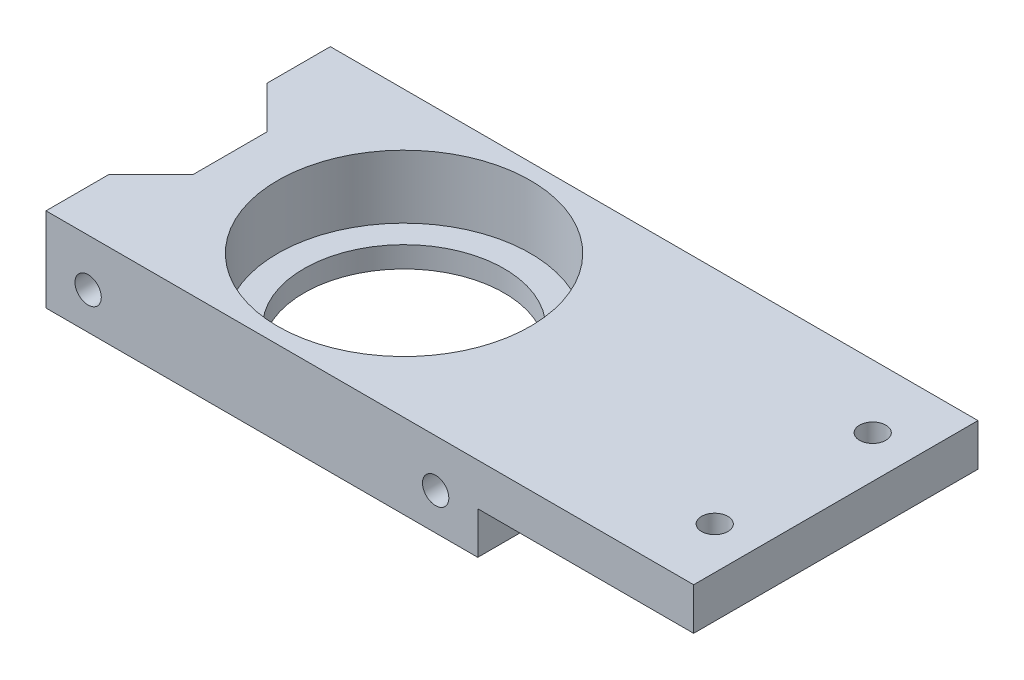
ISO-10303-21;
HEADER;
FILE_DESCRIPTION(('STEP AP214'),'2;1');
FILE_NAME('part.step','',(''),(''),'','','');
FILE_SCHEMA(('AUTOMOTIVE_DESIGN { 1 0 10303 214 1 1 1 1 }'));
ENDSEC;
DATA;
#1=APPLICATION_CONTEXT('core data for automotive mechanical design processes');
#2=APPLICATION_PROTOCOL_DEFINITION('international standard','automotive_design',2000,#1);
#3=PRODUCT_CONTEXT('',#1,'mechanical');
#4=PRODUCT('Part','Part','',(#3));
#5=PRODUCT_RELATED_PRODUCT_CATEGORY('part','',(#4));
#6=PRODUCT_DEFINITION_FORMATION('','',#4);
#7=PRODUCT_DEFINITION_CONTEXT('part definition',#1,'design');
#8=PRODUCT_DEFINITION('design','',#6,#7);
#9=PRODUCT_DEFINITION_SHAPE('','',#8);
#10=(LENGTH_UNIT() NAMED_UNIT(*) SI_UNIT(.MILLI.,.METRE.));
#11=(NAMED_UNIT(*) PLANE_ANGLE_UNIT() SI_UNIT($,.RADIAN.));
#12=(NAMED_UNIT(*) SI_UNIT($,.STERADIAN.) SOLID_ANGLE_UNIT());
#13=UNCERTAINTY_MEASURE_WITH_UNIT(LENGTH_MEASURE(1.E-05),#10,'distance_accuracy_value','');
#14=(GEOMETRIC_REPRESENTATION_CONTEXT(3) GLOBAL_UNCERTAINTY_ASSIGNED_CONTEXT((#13)) GLOBAL_UNIT_ASSIGNED_CONTEXT((#10,
#11,#12)) REPRESENTATION_CONTEXT('',''));
#15=CARTESIAN_POINT('',(0.,0.,0.));
#16=DIRECTION('',(0.,0.,1.));
#17=DIRECTION('',(1.,0.,0.));
#18=AXIS2_PLACEMENT_3D('',#15,#16,#17);
#19=CARTESIAN_POINT('',(0.,8.,0.));
#20=DIRECTION('',(0.,-1.,0.));
#21=DIRECTION('',(0.,0.,-1.));
#22=AXIS2_PLACEMENT_3D('',#19,#20,#21);
#23=CYLINDRICAL_SURFACE('',#22,9.5);
#24=CARTESIAN_POINT('',(0.,0.,0.));
#25=DIRECTION('',(0.,1.,0.));
#26=DIRECTION('',(0.,0.,1.));
#27=AXIS2_PLACEMENT_3D('',#24,#25,#26);
#28=CIRCLE('',#27,9.5);
#29=CARTESIAN_POINT('',(0.,0.,9.5));
#30=VERTEX_POINT('',#29);
#31=EDGE_CURVE('E143',#30,#30,#28,.T.);
#32=ORIENTED_EDGE('',*,*,#31,.F.);
#33=EDGE_LOOP('',(#32));
#34=FACE_BOUND('',#33,.T.);
#35=CARTESIAN_POINT('',(0.,2.,0.));
#36=DIRECTION('',(0.,1.,0.));
#37=DIRECTION('',(0.,0.,1.));
#38=AXIS2_PLACEMENT_3D('',#35,#36,#37);
#39=CIRCLE('',#38,9.5);
#40=CARTESIAN_POINT('',(0.,2.,9.5));
#41=VERTEX_POINT('',#40);
#42=EDGE_CURVE('E39',#41,#41,#39,.T.);
#43=ORIENTED_EDGE('',*,*,#42,.T.);
#44=EDGE_LOOP('',(#43));
#45=FACE_BOUND('',#44,.T.);
#46=ADVANCED_FACE('F35',(#34,#45),#23,.F.);
#47=CARTESIAN_POINT('',(0.,8.,0.));
#48=DIRECTION('',(0.,-1.,0.));
#49=DIRECTION('',(0.,0.,-1.));
#50=AXIS2_PLACEMENT_3D('',#47,#48,#49);
#51=PLANE('',#50);
#52=CARTESIAN_POINT('',(37.,8.,-7.5));
#53=DIRECTION('',(0.,-1.,0.));
#54=DIRECTION('',(0.,0.,1.));
#55=AXIS2_PLACEMENT_3D('',#52,#53,#54);
#56=CIRCLE('',#55,1.25000000000001);
#57=CARTESIAN_POINT('',(37.,8.,-6.25));
#58=VERTEX_POINT('',#57);
#59=EDGE_CURVE('E299',#58,#58,#56,.T.);
#60=ORIENTED_EDGE('',*,*,#59,.T.);
#61=EDGE_LOOP('',(#60));
#62=FACE_BOUND('',#61,.T.);
#63=CARTESIAN_POINT('',(37.,8.,7.5));
#64=DIRECTION('',(0.,-1.,0.));
#65=DIRECTION('',(0.,0.,-1.));
#66=AXIS2_PLACEMENT_3D('',#63,#64,#65);
#67=CIRCLE('',#66,1.25000000000001);
#68=CARTESIAN_POINT('',(37.,8.,6.25));
#69=VERTEX_POINT('',#68);
#70=EDGE_CURVE('E186',#69,#69,#67,.T.);
#71=ORIENTED_EDGE('',*,*,#70,.T.);
#72=EDGE_LOOP('',(#71));
#73=FACE_BOUND('',#72,.T.);
#74=CARTESIAN_POINT('',(0.,8.,0.));
#75=DIRECTION('',(0.,1.,0.));
#76=DIRECTION('',(0.,0.,1.));
#77=AXIS2_PLACEMENT_3D('',#74,#75,#76);
#78=CIRCLE('',#77,12.);
#79=CARTESIAN_POINT('',(0.,8.,12.));
#80=VERTEX_POINT('',#79);
#81=EDGE_CURVE('E197',#80,#80,#78,.T.);
#82=ORIENTED_EDGE('',*,*,#81,.F.);
#83=EDGE_LOOP('',(#82));
#84=FACE_BOUND('',#83,.T.);
#85=DIRECTION('',(1.,0.,0.));
#86=VECTOR('',#85,1.);
#87=CARTESIAN_POINT('',(-20.5,8.,13.5));
#88=LINE('',#87,#86);
#89=CARTESIAN_POINT('',(-20.5,8.,13.5));
#90=VERTEX_POINT('',#89);
#91=CARTESIAN_POINT('',(41.,8.,13.5));
#92=VERTEX_POINT('',#91);
#93=EDGE_CURVE('E153',#90,#92,#88,.T.);
#94=ORIENTED_EDGE('',*,*,#93,.T.);
#95=DIRECTION('',(0.,0.,-1.));
#96=VECTOR('',#95,1.);
#97=CARTESIAN_POINT('',(41.,8.,-13.5));
#98=LINE('',#97,#96);
#99=CARTESIAN_POINT('',(41.,8.,-13.5));
#100=VERTEX_POINT('',#99);
#101=EDGE_CURVE('E95',#92,#100,#98,.T.);
#102=ORIENTED_EDGE('',*,*,#101,.T.);
#103=DIRECTION('',(-1.,0.,0.));
#104=VECTOR('',#103,1.);
#105=CARTESIAN_POINT('',(-20.5,8.,-13.5));
#106=LINE('',#105,#104);
#107=CARTESIAN_POINT('',(-20.5,8.,-13.5));
#108=VERTEX_POINT('',#107);
#109=EDGE_CURVE('E171',#100,#108,#106,.T.);
#110=ORIENTED_EDGE('',*,*,#109,.T.);
#111=DIRECTION('',(0.,0.,1.));
#112=VECTOR('',#111,1.);
#113=CARTESIAN_POINT('',(-20.5,8.,-13.5));
#114=LINE('',#113,#112);
#115=CARTESIAN_POINT('',(-20.5,8.,-7.5));
#116=VERTEX_POINT('',#115);
#117=EDGE_CURVE('E210',#108,#116,#114,.T.);
#118=ORIENTED_EDGE('',*,*,#117,.T.);
#119=DIRECTION('',(0.707106781186549,0.,0.707106781186546));
#120=VECTOR('',#119,1.);
#121=CARTESIAN_POINT('',(-20.5,8.,-7.5));
#122=LINE('',#121,#120);
#123=CARTESIAN_POINT('',(-16.5,8.,-3.5));
#124=VERTEX_POINT('',#123);
#125=EDGE_CURVE('E118',#116,#124,#122,.T.);
#126=ORIENTED_EDGE('',*,*,#125,.T.);
#127=DIRECTION('',(0.,0.,1.));
#128=VECTOR('',#127,1.);
#129=CARTESIAN_POINT('',(-16.5,8.,3.5));
#130=LINE('',#129,#128);
#131=CARTESIAN_POINT('',(-16.5,8.,3.5));
#132=VERTEX_POINT('',#131);
#133=EDGE_CURVE('E111',#124,#132,#130,.T.);
#134=ORIENTED_EDGE('',*,*,#133,.T.);
#135=DIRECTION('',(-0.707106781186548,0.,0.707106781186546));
#136=VECTOR('',#135,1.);
#137=CARTESIAN_POINT('',(-20.5,8.,7.5));
#138=LINE('',#137,#136);
#139=CARTESIAN_POINT('',(-20.5,8.,7.5));
#140=VERTEX_POINT('',#139);
#141=EDGE_CURVE('E115',#132,#140,#138,.T.);
#142=ORIENTED_EDGE('',*,*,#141,.T.);
#143=DIRECTION('',(0.,0.,1.));
#144=VECTOR('',#143,1.);
#145=CARTESIAN_POINT('',(-20.5,8.,13.5));
#146=LINE('',#145,#144);
#147=EDGE_CURVE('E60',#140,#90,#146,.T.);
#148=ORIENTED_EDGE('',*,*,#147,.T.);
#149=EDGE_LOOP('',(#94,#102,#110,#118,#126,#134,#142,#148));
#150=FACE_BOUND('',#149,.T.);
#151=ADVANCED_FACE('F113',(#62,#73,#84,#150),#51,.F.);
#152=CARTESIAN_POINT('',(0.,0.,0.));
#153=DIRECTION('',(0.,-1.,0.));
#154=DIRECTION('',(0.,0.,-1.));
#155=AXIS2_PLACEMENT_3D('',#152,#153,#154);
#156=PLANE('',#155);
#157=DIRECTION('',(0.,0.,-1.));
#158=VECTOR('',#157,1.);
#159=CARTESIAN_POINT('',(20.5,0.,13.5));
#160=LINE('',#159,#158);
#161=CARTESIAN_POINT('',(20.5,0.,13.5));
#162=VERTEX_POINT('',#161);
#163=CARTESIAN_POINT('',(20.5,0.,-13.5));
#164=VERTEX_POINT('',#163);
#165=EDGE_CURVE('E182',#162,#164,#160,.T.);
#166=ORIENTED_EDGE('',*,*,#165,.F.);
#167=DIRECTION('',(1.,0.,0.));
#168=VECTOR('',#167,1.);
#169=CARTESIAN_POINT('',(-20.5,0.,13.5));
#170=LINE('',#169,#168);
#171=CARTESIAN_POINT('',(-20.5,0.,13.5));
#172=VERTEX_POINT('',#171);
#173=EDGE_CURVE('E139',#172,#162,#170,.T.);
#174=ORIENTED_EDGE('',*,*,#173,.F.);
#175=DIRECTION('',(0.,0.,1.));
#176=VECTOR('',#175,1.);
#177=CARTESIAN_POINT('',(-20.5,0.,13.5));
#178=LINE('',#177,#176);
#179=CARTESIAN_POINT('',(-20.5,0.,7.5));
#180=VERTEX_POINT('',#179);
#181=EDGE_CURVE('E87',#180,#172,#178,.T.);
#182=ORIENTED_EDGE('',*,*,#181,.F.);
#183=DIRECTION('',(-0.707106781186548,0.,0.707106781186546));
#184=VECTOR('',#183,1.);
#185=CARTESIAN_POINT('',(-20.5,0.,7.5));
#186=LINE('',#185,#184);
#187=CARTESIAN_POINT('',(-16.5,0.,3.5));
#188=VERTEX_POINT('',#187);
#189=EDGE_CURVE('E150',#188,#180,#186,.T.);
#190=ORIENTED_EDGE('',*,*,#189,.F.);
#191=DIRECTION('',(0.,0.,1.));
#192=VECTOR('',#191,1.);
#193=CARTESIAN_POINT('',(-16.5,0.,3.5));
#194=LINE('',#193,#192);
#195=CARTESIAN_POINT('',(-16.5,0.,-3.5));
#196=VERTEX_POINT('',#195);
#197=EDGE_CURVE('E127',#196,#188,#194,.T.);
#198=ORIENTED_EDGE('',*,*,#197,.F.);
#199=DIRECTION('',(0.707106781186549,0.,0.707106781186546));
#200=VECTOR('',#199,1.);
#201=CARTESIAN_POINT('',(-20.5,0.,-7.5));
#202=LINE('',#201,#200);
#203=CARTESIAN_POINT('',(-20.5,0.,-7.5));
#204=VERTEX_POINT('',#203);
#205=EDGE_CURVE('E147',#204,#196,#202,.T.);
#206=ORIENTED_EDGE('',*,*,#205,.F.);
#207=DIRECTION('',(0.,0.,1.));
#208=VECTOR('',#207,1.);
#209=CARTESIAN_POINT('',(-20.5,0.,-13.5));
#210=LINE('',#209,#208);
#211=CARTESIAN_POINT('',(-20.5,0.,-13.5));
#212=VERTEX_POINT('',#211);
#213=EDGE_CURVE('E145',#212,#204,#210,.T.);
#214=ORIENTED_EDGE('',*,*,#213,.F.);
#215=DIRECTION('',(-1.,0.,0.));
#216=VECTOR('',#215,1.);
#217=CARTESIAN_POINT('',(-20.5,0.,-13.5));
#218=LINE('',#217,#216);
#219=EDGE_CURVE('E142',#164,#212,#218,.T.);
#220=ORIENTED_EDGE('',*,*,#219,.F.);
#221=EDGE_LOOP('',(#166,#174,#182,#190,#198,#206,#214,#220));
#222=FACE_BOUND('',#221,.T.);
#223=ORIENTED_EDGE('',*,*,#31,.T.);
#224=EDGE_LOOP('',(#223));
#225=FACE_BOUND('',#224,.T.);
#226=ADVANCED_FACE('F221',(#222,#225),#156,.T.);
#227=CARTESIAN_POINT('',(-20.5,8.,13.5));
#228=DIRECTION('',(0.,0.,-1.));
#229=DIRECTION('',(-1.,0.,0.));
#230=AXIS2_PLACEMENT_3D('',#227,#228,#229);
#231=PLANE('',#230);
#232=CARTESIAN_POINT('',(16.5,3.50001895123856,13.5));
#233=DIRECTION('',(0.,0.,1.));
#234=DIRECTION('',(-1.,0.,0.));
#235=AXIS2_PLACEMENT_3D('',#232,#233,#234);
#236=CIRCLE('',#235,1.25);
#237=CARTESIAN_POINT('',(15.25,3.50001895123856,13.5));
#238=VERTEX_POINT('',#237);
#239=EDGE_CURVE('E284',#238,#238,#236,.T.);
#240=ORIENTED_EDGE('',*,*,#239,.F.);
#241=EDGE_LOOP('',(#240));
#242=FACE_BOUND('',#241,.T.);
#243=CARTESIAN_POINT('',(-16.5,3.50001895123856,13.5));
#244=DIRECTION('',(0.,0.,1.));
#245=DIRECTION('',(1.,0.,0.));
#246=AXIS2_PLACEMENT_3D('',#243,#244,#245);
#247=CIRCLE('',#246,1.25);
#248=CARTESIAN_POINT('',(-15.25,3.50001895123856,13.5));
#249=VERTEX_POINT('',#248);
#250=EDGE_CURVE('E287',#249,#249,#247,.T.);
#251=ORIENTED_EDGE('',*,*,#250,.F.);
#252=EDGE_LOOP('',(#251));
#253=FACE_BOUND('',#252,.T.);
#254=ORIENTED_EDGE('',*,*,#173,.T.);
#255=DIRECTION('',(0.,-1.,0.));
#256=VECTOR('',#255,1.);
#257=CARTESIAN_POINT('',(20.5,4.,13.5));
#258=LINE('',#257,#256);
#259=CARTESIAN_POINT('',(20.5,4.,13.5));
#260=VERTEX_POINT('',#259);
#261=EDGE_CURVE('E193',#260,#162,#258,.T.);
#262=ORIENTED_EDGE('',*,*,#261,.F.);
#263=DIRECTION('',(-1.,0.,0.));
#264=VECTOR('',#263,1.);
#265=CARTESIAN_POINT('',(41.,4.,13.5));
#266=LINE('',#265,#264);
#267=CARTESIAN_POINT('',(41.,4.,13.5));
#268=VERTEX_POINT('',#267);
#269=EDGE_CURVE('E181',#268,#260,#266,.T.);
#270=ORIENTED_EDGE('',*,*,#269,.F.);
#271=DIRECTION('',(0.,-1.,0.));
#272=VECTOR('',#271,1.);
#273=CARTESIAN_POINT('',(41.,8.,13.5));
#274=LINE('',#273,#272);
#275=EDGE_CURVE('E11',#92,#268,#274,.T.);
#276=ORIENTED_EDGE('',*,*,#275,.F.);
#277=ORIENTED_EDGE('',*,*,#93,.F.);
#278=DIRECTION('',(0.,-1.,0.));
#279=VECTOR('',#278,1.);
#280=CARTESIAN_POINT('',(-20.5,8.,13.5));
#281=LINE('',#280,#279);
#282=EDGE_CURVE('E135',#90,#172,#281,.T.);
#283=ORIENTED_EDGE('',*,*,#282,.T.);
#284=EDGE_LOOP('',(#254,#262,#270,#276,#277,#283));
#285=FACE_BOUND('',#284,.T.);
#286=ADVANCED_FACE('F37',(#242,#253,#285),#231,.F.);
#287=CARTESIAN_POINT('',(41.,8.,-13.5));
#288=DIRECTION('',(-1.,0.,0.));
#289=DIRECTION('',(0.,0.,1.));
#290=AXIS2_PLACEMENT_3D('',#287,#288,#289);
#291=PLANE('',#290);
#292=ORIENTED_EDGE('',*,*,#275,.T.);
#293=DIRECTION('',(0.,0.,1.));
#294=VECTOR('',#293,1.);
#295=CARTESIAN_POINT('',(41.,4.,13.5));
#296=LINE('',#295,#294);
#297=CARTESIAN_POINT('',(41.,4.,-13.5));
#298=VERTEX_POINT('',#297);
#299=EDGE_CURVE('E177',#298,#268,#296,.T.);
#300=ORIENTED_EDGE('',*,*,#299,.F.);
#301=DIRECTION('',(0.,-1.,0.));
#302=VECTOR('',#301,1.);
#303=CARTESIAN_POINT('',(41.,8.,-13.5));
#304=LINE('',#303,#302);
#305=EDGE_CURVE('E44',#100,#298,#304,.T.);
#306=ORIENTED_EDGE('',*,*,#305,.F.);
#307=ORIENTED_EDGE('',*,*,#101,.F.);
#308=EDGE_LOOP('',(#292,#300,#306,#307));
#309=FACE_BOUND('',#308,.T.);
#310=ADVANCED_FACE('F175',(#309),#291,.F.);
#311=CARTESIAN_POINT('',(-20.5,8.,-13.5));
#312=DIRECTION('',(0.,0.,1.));
#313=DIRECTION('',(1.,0.,0.));
#314=AXIS2_PLACEMENT_3D('',#311,#312,#313);
#315=PLANE('',#314);
#316=CARTESIAN_POINT('',(16.5,4.00000000000001,-13.5));
#317=DIRECTION('',(0.,0.,-1.));
#318=DIRECTION('',(1.,0.,0.));
#319=AXIS2_PLACEMENT_3D('',#316,#317,#318);
#320=CIRCLE('',#319,1.25);
#321=CARTESIAN_POINT('',(17.75,4.00000000000001,-13.5));
#322=VERTEX_POINT('',#321);
#323=EDGE_CURVE('E357',#322,#322,#320,.T.);
#324=ORIENTED_EDGE('',*,*,#323,.F.);
#325=EDGE_LOOP('',(#324));
#326=FACE_BOUND('',#325,.T.);
#327=CARTESIAN_POINT('',(-16.5,4.,-13.5));
#328=DIRECTION('',(0.,0.,-1.));
#329=DIRECTION('',(-1.,0.,0.));
#330=AXIS2_PLACEMENT_3D('',#327,#328,#329);
#331=CIRCLE('',#330,1.25);
#332=CARTESIAN_POINT('',(-17.75,4.,-13.5));
#333=VERTEX_POINT('',#332);
#334=EDGE_CURVE('E356',#333,#333,#331,.T.);
#335=ORIENTED_EDGE('',*,*,#334,.F.);
#336=EDGE_LOOP('',(#335));
#337=FACE_BOUND('',#336,.T.);
#338=DIRECTION('',(1.,0.,0.));
#339=VECTOR('',#338,1.);
#340=CARTESIAN_POINT('',(41.,4.,-13.5));
#341=LINE('',#340,#339);
#342=CARTESIAN_POINT('',(20.5,4.,-13.5));
#343=VERTEX_POINT('',#342);
#344=EDGE_CURVE('E169',#343,#298,#341,.T.);
#345=ORIENTED_EDGE('',*,*,#344,.F.);
#346=DIRECTION('',(0.,-1.,0.));
#347=VECTOR('',#346,1.);
#348=CARTESIAN_POINT('',(20.5,4.,-13.5));
#349=LINE('',#348,#347);
#350=EDGE_CURVE('E195',#343,#164,#349,.T.);
#351=ORIENTED_EDGE('',*,*,#350,.T.);
#352=ORIENTED_EDGE('',*,*,#219,.T.);
#353=DIRECTION('',(0.,-1.,0.));
#354=VECTOR('',#353,1.);
#355=CARTESIAN_POINT('',(-20.5,8.,-13.5));
#356=LINE('',#355,#354);
#357=EDGE_CURVE('E160',#108,#212,#356,.T.);
#358=ORIENTED_EDGE('',*,*,#357,.F.);
#359=ORIENTED_EDGE('',*,*,#109,.F.);
#360=ORIENTED_EDGE('',*,*,#305,.T.);
#361=EDGE_LOOP('',(#345,#351,#352,#358,#359,#360));
#362=FACE_BOUND('',#361,.T.);
#363=ADVANCED_FACE('F167',(#326,#337,#362),#315,.F.);
#364=CARTESIAN_POINT('',(-20.5,8.,-13.5));
#365=DIRECTION('',(1.,0.,0.));
#366=DIRECTION('',(0.,0.,-1.));
#367=AXIS2_PLACEMENT_3D('',#364,#365,#366);
#368=PLANE('',#367);
#369=ORIENTED_EDGE('',*,*,#213,.T.);
#370=DIRECTION('',(0.,-1.,0.));
#371=VECTOR('',#370,1.);
#372=CARTESIAN_POINT('',(-20.5,8.,-7.5));
#373=LINE('',#372,#371);
#374=EDGE_CURVE('E157',#116,#204,#373,.T.);
#375=ORIENTED_EDGE('',*,*,#374,.F.);
#376=ORIENTED_EDGE('',*,*,#117,.F.);
#377=ORIENTED_EDGE('',*,*,#357,.T.);
#378=EDGE_LOOP('',(#369,#375,#376,#377));
#379=FACE_BOUND('',#378,.T.);
#380=ADVANCED_FACE('F214',(#379),#368,.F.);
#381=CARTESIAN_POINT('',(-20.5,8.,-7.5));
#382=DIRECTION('',(0.707106781186546,0.,-0.707106781186549));
#383=DIRECTION('',(-0.707106781186549,0.,-0.707106781186546));
#384=AXIS2_PLACEMENT_3D('',#381,#382,#383);
#385=PLANE('',#384);
#386=ORIENTED_EDGE('',*,*,#205,.T.);
#387=DIRECTION('',(0.,-1.,0.));
#388=VECTOR('',#387,1.);
#389=CARTESIAN_POINT('',(-16.5,8.,-3.5));
#390=LINE('',#389,#388);
#391=EDGE_CURVE('E130',#124,#196,#390,.T.);
#392=ORIENTED_EDGE('',*,*,#391,.F.);
#393=ORIENTED_EDGE('',*,*,#125,.F.);
#394=ORIENTED_EDGE('',*,*,#374,.T.);
#395=EDGE_LOOP('',(#386,#392,#393,#394));
#396=FACE_BOUND('',#395,.T.);
#397=ADVANCED_FACE('F218',(#396),#385,.F.);
#398=CARTESIAN_POINT('',(-16.5,8.,3.5));
#399=DIRECTION('',(1.,0.,0.));
#400=DIRECTION('',(0.,0.,-1.));
#401=AXIS2_PLACEMENT_3D('',#398,#399,#400);
#402=PLANE('',#401);
#403=ORIENTED_EDGE('',*,*,#197,.T.);
#404=DIRECTION('',(0.,-1.,0.));
#405=VECTOR('',#404,1.);
#406=CARTESIAN_POINT('',(-16.5,8.,3.5));
#407=LINE('',#406,#405);
#408=EDGE_CURVE('E124',#132,#188,#407,.T.);
#409=ORIENTED_EDGE('',*,*,#408,.F.);
#410=ORIENTED_EDGE('',*,*,#133,.F.);
#411=ORIENTED_EDGE('',*,*,#391,.T.);
#412=EDGE_LOOP('',(#403,#409,#410,#411));
#413=FACE_BOUND('',#412,.T.);
#414=ADVANCED_FACE('F125',(#413),#402,.F.);
#415=CARTESIAN_POINT('',(-20.5,8.,7.5));
#416=DIRECTION('',(0.707106781186546,0.,0.707106781186549));
#417=DIRECTION('',(0.707106781186549,0.,-0.707106781186546));
#418=AXIS2_PLACEMENT_3D('',#415,#416,#417);
#419=PLANE('',#418);
#420=ORIENTED_EDGE('',*,*,#189,.T.);
#421=DIRECTION('',(0.,-1.,0.));
#422=VECTOR('',#421,1.);
#423=CARTESIAN_POINT('',(-20.5,8.,7.5));
#424=LINE('',#423,#422);
#425=EDGE_CURVE('E131',#140,#180,#424,.T.);
#426=ORIENTED_EDGE('',*,*,#425,.F.);
#427=ORIENTED_EDGE('',*,*,#141,.F.);
#428=ORIENTED_EDGE('',*,*,#408,.T.);
#429=EDGE_LOOP('',(#420,#426,#427,#428));
#430=FACE_BOUND('',#429,.T.);
#431=ADVANCED_FACE('F133',(#430),#419,.F.);
#432=CARTESIAN_POINT('',(-20.5,8.,13.5));
#433=DIRECTION('',(1.,0.,0.));
#434=DIRECTION('',(0.,0.,-1.));
#435=AXIS2_PLACEMENT_3D('',#432,#433,#434);
#436=PLANE('',#435);
#437=ORIENTED_EDGE('',*,*,#181,.T.);
#438=ORIENTED_EDGE('',*,*,#282,.F.);
#439=ORIENTED_EDGE('',*,*,#147,.F.);
#440=ORIENTED_EDGE('',*,*,#425,.T.);
#441=EDGE_LOOP('',(#437,#438,#439,#440));
#442=FACE_BOUND('',#441,.T.);
#443=ADVANCED_FACE('F224',(#442),#436,.F.);
#444=CARTESIAN_POINT('',(0.,2.,0.));
#445=DIRECTION('',(0.,1.,0.));
#446=DIRECTION('',(0.,0.,1.));
#447=AXIS2_PLACEMENT_3D('',#444,#445,#446);
#448=CYLINDRICAL_SURFACE('',#447,12.);
#449=CARTESIAN_POINT('',(0.,2.,0.));
#450=DIRECTION('',(0.,1.,0.));
#451=DIRECTION('',(0.,0.,1.));
#452=AXIS2_PLACEMENT_3D('',#449,#450,#451);
#453=CIRCLE('',#452,12.);
#454=CARTESIAN_POINT('',(0.,2.,12.));
#455=VERTEX_POINT('',#454);
#456=EDGE_CURVE('E200',#455,#455,#453,.T.);
#457=ORIENTED_EDGE('',*,*,#456,.F.);
#458=EDGE_LOOP('',(#457));
#459=FACE_BOUND('',#458,.T.);
#460=ORIENTED_EDGE('',*,*,#81,.T.);
#461=EDGE_LOOP('',(#460));
#462=FACE_BOUND('',#461,.T.);
#463=ADVANCED_FACE('F245',(#459,#462),#448,.F.);
#464=CARTESIAN_POINT('',(0.,2.,0.));
#465=DIRECTION('',(0.,1.,0.));
#466=DIRECTION('',(0.,0.,1.));
#467=AXIS2_PLACEMENT_3D('',#464,#465,#466);
#468=PLANE('',#467);
#469=ORIENTED_EDGE('',*,*,#42,.F.);
#470=EDGE_LOOP('',(#469));
#471=FACE_BOUND('',#470,.T.);
#472=ORIENTED_EDGE('',*,*,#456,.T.);
#473=EDGE_LOOP('',(#472));
#474=FACE_BOUND('',#473,.T.);
#475=ADVANCED_FACE('F236',(#471,#474),#468,.T.);
#476=CARTESIAN_POINT('',(20.5,4.,13.5));
#477=DIRECTION('',(-1.,0.,0.));
#478=DIRECTION('',(0.,0.,1.));
#479=AXIS2_PLACEMENT_3D('',#476,#477,#478);
#480=PLANE('',#479);
#481=ORIENTED_EDGE('',*,*,#165,.T.);
#482=ORIENTED_EDGE('',*,*,#350,.F.);
#483=DIRECTION('',(0.,0.,-1.));
#484=VECTOR('',#483,1.);
#485=CARTESIAN_POINT('',(20.5,4.,13.5));
#486=LINE('',#485,#484);
#487=EDGE_CURVE('E51',#260,#343,#486,.T.);
#488=ORIENTED_EDGE('',*,*,#487,.F.);
#489=ORIENTED_EDGE('',*,*,#261,.T.);
#490=EDGE_LOOP('',(#481,#482,#488,#489));
#491=FACE_BOUND('',#490,.T.);
#492=ADVANCED_FACE('F233',(#491),#480,.F.);
#493=CARTESIAN_POINT('',(0.,4.,0.));
#494=DIRECTION('',(0.,1.,0.));
#495=DIRECTION('',(0.,0.,1.));
#496=AXIS2_PLACEMENT_3D('',#493,#494,#495);
#497=PLANE('',#496);
#498=CARTESIAN_POINT('',(37.,4.,-7.5));
#499=DIRECTION('',(0.,-1.,0.));
#500=DIRECTION('',(0.,0.,1.));
#501=AXIS2_PLACEMENT_3D('',#498,#499,#500);
#502=CIRCLE('',#501,1.25000000000001);
#503=CARTESIAN_POINT('',(37.,4.,-6.25));
#504=VERTEX_POINT('',#503);
#505=EDGE_CURVE('E293',#504,#504,#502,.T.);
#506=ORIENTED_EDGE('',*,*,#505,.F.);
#507=EDGE_LOOP('',(#506));
#508=FACE_BOUND('',#507,.T.);
#509=CARTESIAN_POINT('',(37.,4.,7.5));
#510=DIRECTION('',(0.,-1.,0.));
#511=DIRECTION('',(0.,0.,-1.));
#512=AXIS2_PLACEMENT_3D('',#509,#510,#511);
#513=CIRCLE('',#512,1.25000000000001);
#514=CARTESIAN_POINT('',(37.,4.,6.25));
#515=VERTEX_POINT('',#514);
#516=EDGE_CURVE('E189',#515,#515,#513,.T.);
#517=ORIENTED_EDGE('',*,*,#516,.F.);
#518=EDGE_LOOP('',(#517));
#519=FACE_BOUND('',#518,.T.);
#520=ORIENTED_EDGE('',*,*,#299,.T.);
#521=ORIENTED_EDGE('',*,*,#269,.T.);
#522=ORIENTED_EDGE('',*,*,#487,.T.);
#523=ORIENTED_EDGE('',*,*,#344,.T.);
#524=EDGE_LOOP('',(#520,#521,#522,#523));
#525=FACE_BOUND('',#524,.T.);
#526=ADVANCED_FACE('F229',(#508,#519,#525),#497,.F.);
#527=CARTESIAN_POINT('',(37.,8.,7.5));
#528=DIRECTION('',(0.,-1.,0.));
#529=DIRECTION('',(0.,0.,-1.));
#530=AXIS2_PLACEMENT_3D('',#527,#528,#529);
#531=CYLINDRICAL_SURFACE('',#530,1.25000000000001);
#532=ORIENTED_EDGE('',*,*,#70,.F.);
#533=EDGE_LOOP('',(#532));
#534=FACE_BOUND('',#533,.T.);
#535=ORIENTED_EDGE('',*,*,#516,.T.);
#536=EDGE_LOOP('',(#535));
#537=FACE_BOUND('',#536,.T.);
#538=ADVANCED_FACE('F242',(#534,#537),#531,.F.);
#539=CARTESIAN_POINT('',(37.,8.,-7.5));
#540=DIRECTION('',(0.,-1.,0.));
#541=DIRECTION('',(0.,0.,-1.));
#542=AXIS2_PLACEMENT_3D('',#539,#540,#541);
#543=CYLINDRICAL_SURFACE('',#542,1.25000000000001);
#544=ORIENTED_EDGE('',*,*,#59,.F.);
#545=EDGE_LOOP('',(#544));
#546=FACE_BOUND('',#545,.T.);
#547=ORIENTED_EDGE('',*,*,#505,.T.);
#548=EDGE_LOOP('',(#547));
#549=FACE_BOUND('',#548,.T.);
#550=ADVANCED_FACE('F311',(#546,#549),#543,.F.);
#551=CARTESIAN_POINT('',(-16.5,3.50001895123856,6.5));
#552=DIRECTION('',(0.,0.,1.));
#553=DIRECTION('',(1.,0.,0.));
#554=AXIS2_PLACEMENT_3D('',#551,#552,#553);
#555=CYLINDRICAL_SURFACE('',#554,1.25);
#556=CARTESIAN_POINT('',(-16.5,3.50001895123856,6.5));
#557=DIRECTION('',(0.,0.,1.));
#558=DIRECTION('',(1.,0.,0.));
#559=AXIS2_PLACEMENT_3D('',#556,#557,#558);
#560=CIRCLE('',#559,1.25);
#561=CARTESIAN_POINT('',(-15.25,3.50001895123856,6.5));
#562=VERTEX_POINT('',#561);
#563=EDGE_CURVE('E289',#562,#562,#560,.T.);
#564=ORIENTED_EDGE('',*,*,#563,.F.);
#565=EDGE_LOOP('',(#564));
#566=FACE_BOUND('',#565,.T.);
#567=ORIENTED_EDGE('',*,*,#250,.T.);
#568=EDGE_LOOP('',(#567));
#569=FACE_BOUND('',#568,.T.);
#570=ADVANCED_FACE('F317',(#566,#569),#555,.F.);
#571=CARTESIAN_POINT('',(-16.5,3.50001895123856,6.5));
#572=DIRECTION('',(0.,0.,1.));
#573=DIRECTION('',(1.,0.,0.));
#574=AXIS2_PLACEMENT_3D('',#571,#572,#573);
#575=PLANE('',#574);
#576=ORIENTED_EDGE('',*,*,#563,.T.);
#577=EDGE_LOOP('',(#576));
#578=FACE_BOUND('',#577,.T.);
#579=ADVANCED_FACE('F323',(#578),#575,.T.);
#580=CARTESIAN_POINT('',(16.5,3.50001895123856,6.5));
#581=DIRECTION('',(0.,0.,1.));
#582=DIRECTION('',(1.,0.,0.));
#583=AXIS2_PLACEMENT_3D('',#580,#581,#582);
#584=CYLINDRICAL_SURFACE('',#583,1.25);
#585=CARTESIAN_POINT('',(16.5,3.50001895123856,6.5));
#586=DIRECTION('',(0.,0.,1.));
#587=DIRECTION('',(-1.,0.,0.));
#588=AXIS2_PLACEMENT_3D('',#585,#586,#587);
#589=CIRCLE('',#588,1.25);
#590=CARTESIAN_POINT('',(15.25,3.50001895123856,6.5));
#591=VERTEX_POINT('',#590);
#592=EDGE_CURVE('E290',#591,#591,#589,.T.);
#593=ORIENTED_EDGE('',*,*,#592,.F.);
#594=EDGE_LOOP('',(#593));
#595=FACE_BOUND('',#594,.T.);
#596=ORIENTED_EDGE('',*,*,#239,.T.);
#597=EDGE_LOOP('',(#596));
#598=FACE_BOUND('',#597,.T.);
#599=ADVANCED_FACE('F327',(#595,#598),#584,.F.);
#600=CARTESIAN_POINT('',(16.5,3.50001895123856,6.5));
#601=DIRECTION('',(0.,0.,-1.));
#602=DIRECTION('',(-1.,0.,0.));
#603=AXIS2_PLACEMENT_3D('',#600,#601,#602);
#604=PLANE('',#603);
#605=ORIENTED_EDGE('',*,*,#592,.T.);
#606=EDGE_LOOP('',(#605));
#607=FACE_BOUND('',#606,.T.);
#608=ADVANCED_FACE('F331',(#607),#604,.F.);
#609=CARTESIAN_POINT('',(-16.5,4.,-6.5));
#610=DIRECTION('',(0.,0.,-1.));
#611=DIRECTION('',(-1.,0.,0.));
#612=AXIS2_PLACEMENT_3D('',#609,#610,#611);
#613=CYLINDRICAL_SURFACE('',#612,1.25);
#614=CARTESIAN_POINT('',(-16.5,4.,-6.5));
#615=DIRECTION('',(0.,0.,-1.));
#616=DIRECTION('',(-1.,0.,0.));
#617=AXIS2_PLACEMENT_3D('',#614,#615,#616);
#618=CIRCLE('',#617,1.25);
#619=CARTESIAN_POINT('',(-17.75,4.,-6.5));
#620=VERTEX_POINT('',#619);
#621=EDGE_CURVE('E360',#620,#620,#618,.T.);
#622=ORIENTED_EDGE('',*,*,#621,.F.);
#623=EDGE_LOOP('',(#622));
#624=FACE_BOUND('',#623,.T.);
#625=ORIENTED_EDGE('',*,*,#334,.T.);
#626=EDGE_LOOP('',(#625));
#627=FACE_BOUND('',#626,.T.);
#628=ADVANCED_FACE('F335',(#624,#627),#613,.F.);
#629=CARTESIAN_POINT('',(-16.5,4.,-6.5));
#630=DIRECTION('',(0.,0.,-1.));
#631=DIRECTION('',(-1.,0.,0.));
#632=AXIS2_PLACEMENT_3D('',#629,#630,#631);
#633=PLANE('',#632);
#634=ORIENTED_EDGE('',*,*,#621,.T.);
#635=EDGE_LOOP('',(#634));
#636=FACE_BOUND('',#635,.T.);
#637=ADVANCED_FACE('F339',(#636),#633,.T.);
#638=CARTESIAN_POINT('',(16.5,4.00000000000001,-6.5));
#639=DIRECTION('',(0.,0.,-1.));
#640=DIRECTION('',(-1.,0.,0.));
#641=AXIS2_PLACEMENT_3D('',#638,#639,#640);
#642=CYLINDRICAL_SURFACE('',#641,1.25);
#643=CARTESIAN_POINT('',(16.5,4.00000000000001,-6.5));
#644=DIRECTION('',(0.,0.,-1.));
#645=DIRECTION('',(1.,0.,0.));
#646=AXIS2_PLACEMENT_3D('',#643,#644,#645);
#647=CIRCLE('',#646,1.25);
#648=CARTESIAN_POINT('',(17.75,4.00000000000001,-6.5));
#649=VERTEX_POINT('',#648);
#650=EDGE_CURVE('E355',#649,#649,#647,.T.);
#651=ORIENTED_EDGE('',*,*,#650,.F.);
#652=EDGE_LOOP('',(#651));
#653=FACE_BOUND('',#652,.T.);
#654=ORIENTED_EDGE('',*,*,#323,.T.);
#655=EDGE_LOOP('',(#654));
#656=FACE_BOUND('',#655,.T.);
#657=ADVANCED_FACE('F343',(#653,#656),#642,.F.);
#658=CARTESIAN_POINT('',(16.5,4.00000000000001,-6.5));
#659=DIRECTION('',(0.,0.,1.));
#660=DIRECTION('',(1.,0.,0.));
#661=AXIS2_PLACEMENT_3D('',#658,#659,#660);
#662=PLANE('',#661);
#663=ORIENTED_EDGE('',*,*,#650,.T.);
#664=EDGE_LOOP('',(#663));
#665=FACE_BOUND('',#664,.T.);
#666=ADVANCED_FACE('F347',(#665),#662,.F.);
#667=CLOSED_SHELL('',(#46,#151,#226,#286,#310,#363,#380,#397,#414,#431,#443,#463,#475,#492,#526,
#538,#550,#570,#579,#599,#608,#628,#637,#657,#666));
#668=MANIFOLD_SOLID_BREP('B2',#667);
#669=ADVANCED_BREP_SHAPE_REPRESENTATION('',(#18,#668),#14);
#670=SHAPE_DEFINITION_REPRESENTATION(#9,#669);
ENDSEC;
END-ISO-10303-21;
